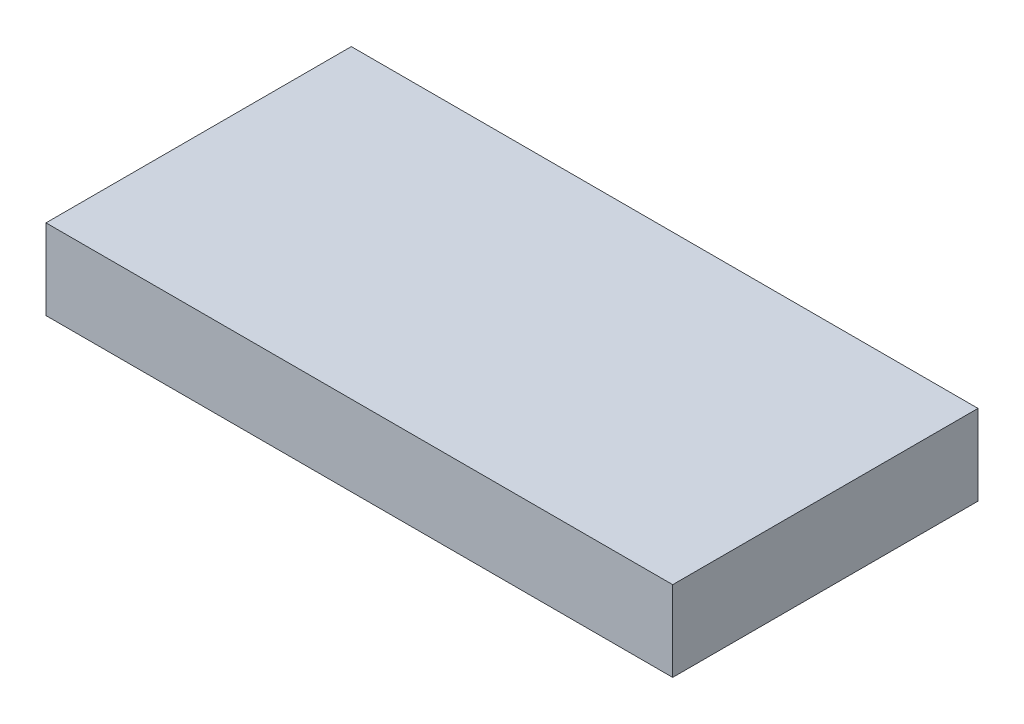
ISO-10303-21;
HEADER;
FILE_DESCRIPTION(('STEP AP214'),'2;1');
FILE_NAME('part.step','',(''),(''),'','','');
FILE_SCHEMA(('AUTOMOTIVE_DESIGN { 1 0 10303 214 1 1 1 1 }'));
ENDSEC;
DATA;
#1=APPLICATION_CONTEXT('core data for automotive mechanical design processes');
#2=APPLICATION_PROTOCOL_DEFINITION('international standard','automotive_design',2000,#1);
#3=PRODUCT_CONTEXT('',#1,'mechanical');
#4=PRODUCT('Part','Part','',(#3));
#5=PRODUCT_RELATED_PRODUCT_CATEGORY('part','',(#4));
#6=PRODUCT_DEFINITION_FORMATION('','',#4);
#7=PRODUCT_DEFINITION_CONTEXT('part definition',#1,'design');
#8=PRODUCT_DEFINITION('design','',#6,#7);
#9=PRODUCT_DEFINITION_SHAPE('','',#8);
#10=(LENGTH_UNIT() NAMED_UNIT(*) SI_UNIT(.MILLI.,.METRE.));
#11=(NAMED_UNIT(*) PLANE_ANGLE_UNIT() SI_UNIT($,.RADIAN.));
#12=(NAMED_UNIT(*) SI_UNIT($,.STERADIAN.) SOLID_ANGLE_UNIT());
#13=UNCERTAINTY_MEASURE_WITH_UNIT(LENGTH_MEASURE(1.E-05),#10,'distance_accuracy_value','');
#14=(GEOMETRIC_REPRESENTATION_CONTEXT(3) GLOBAL_UNCERTAINTY_ASSIGNED_CONTEXT((#13)) GLOBAL_UNIT_ASSIGNED_CONTEXT((#10,
#11,#12)) REPRESENTATION_CONTEXT('',''));
#15=CARTESIAN_POINT('',(0.,0.,0.));
#16=DIRECTION('',(0.,0.,1.));
#17=DIRECTION('',(1.,0.,0.));
#18=AXIS2_PLACEMENT_3D('',#15,#16,#17);
#19=CARTESIAN_POINT('',(19.5,5.,9.5));
#20=DIRECTION('',(-1.,0.,0.));
#21=DIRECTION('',(0.,0.,1.));
#22=AXIS2_PLACEMENT_3D('',#19,#20,#21);
#23=PLANE('',#22);
#24=DIRECTION('',(0.,0.,-1.));
#25=VECTOR('',#24,1.);
#26=CARTESIAN_POINT('',(19.5,0.,9.5));
#27=LINE('',#26,#25);
#28=CARTESIAN_POINT('',(19.5,0.,9.5));
#29=VERTEX_POINT('',#28);
#30=CARTESIAN_POINT('',(19.5,0.,-9.5));
#31=VERTEX_POINT('',#30);
#32=EDGE_CURVE('E97',#29,#31,#27,.T.);
#33=ORIENTED_EDGE('',*,*,#32,.T.);
#34=DIRECTION('',(0.,-1.,0.));
#35=VECTOR('',#34,1.);
#36=CARTESIAN_POINT('',(19.5,5.,-9.5));
#37=LINE('',#36,#35);
#38=CARTESIAN_POINT('',(19.5,5.,-9.5));
#39=VERTEX_POINT('',#38);
#40=EDGE_CURVE('E11',#39,#31,#37,.T.);
#41=ORIENTED_EDGE('',*,*,#40,.F.);
#42=DIRECTION('',(0.,0.,-1.));
#43=VECTOR('',#42,1.);
#44=CARTESIAN_POINT('',(19.5,5.,9.5));
#45=LINE('',#44,#43);
#46=CARTESIAN_POINT('',(19.5,5.,9.5));
#47=VERTEX_POINT('',#46);
#48=EDGE_CURVE('E85',#47,#39,#45,.T.);
#49=ORIENTED_EDGE('',*,*,#48,.F.);
#50=DIRECTION('',(0.,-1.,0.));
#51=VECTOR('',#50,1.);
#52=CARTESIAN_POINT('',(19.5,5.,9.5));
#53=LINE('',#52,#51);
#54=EDGE_CURVE('E93',#47,#29,#53,.T.);
#55=ORIENTED_EDGE('',*,*,#54,.T.);
#56=EDGE_LOOP('',(#33,#41,#49,#55));
#57=FACE_BOUND('',#56,.T.);
#58=ADVANCED_FACE('F34',(#57),#23,.F.);
#59=CARTESIAN_POINT('',(-19.5,5.,-9.5));
#60=DIRECTION('',(0.,0.,1.));
#61=DIRECTION('',(1.,0.,0.));
#62=AXIS2_PLACEMENT_3D('',#59,#60,#61);
#63=PLANE('',#62);
#64=DIRECTION('',(-1.,0.,0.));
#65=VECTOR('',#64,1.);
#66=CARTESIAN_POINT('',(-19.5,0.,-9.5));
#67=LINE('',#66,#65);
#68=CARTESIAN_POINT('',(-19.5,0.,-9.5));
#69=VERTEX_POINT('',#68);
#70=EDGE_CURVE('E89',#31,#69,#67,.T.);
#71=ORIENTED_EDGE('',*,*,#70,.T.);
#72=DIRECTION('',(0.,-1.,0.));
#73=VECTOR('',#72,1.);
#74=CARTESIAN_POINT('',(-19.5,5.,-9.5));
#75=LINE('',#74,#73);
#76=CARTESIAN_POINT('',(-19.5,5.,-9.5));
#77=VERTEX_POINT('',#76);
#78=EDGE_CURVE('E42',#77,#69,#75,.T.);
#79=ORIENTED_EDGE('',*,*,#78,.F.);
#80=DIRECTION('',(-1.,0.,0.));
#81=VECTOR('',#80,1.);
#82=CARTESIAN_POINT('',(-19.5,5.,-9.5));
#83=LINE('',#82,#81);
#84=EDGE_CURVE('E80',#39,#77,#83,.T.);
#85=ORIENTED_EDGE('',*,*,#84,.F.);
#86=ORIENTED_EDGE('',*,*,#40,.T.);
#87=EDGE_LOOP('',(#71,#79,#85,#86));
#88=FACE_BOUND('',#87,.T.);
#89=ADVANCED_FACE('F88',(#88),#63,.F.);
#90=CARTESIAN_POINT('',(-19.5,5.,9.5));
#91=DIRECTION('',(1.,0.,0.));
#92=DIRECTION('',(0.,0.,-1.));
#93=AXIS2_PLACEMENT_3D('',#90,#91,#92);
#94=PLANE('',#93);
#95=DIRECTION('',(0.,0.,1.));
#96=VECTOR('',#95,1.);
#97=CARTESIAN_POINT('',(-19.5,0.,9.5));
#98=LINE('',#97,#96);
#99=CARTESIAN_POINT('',(-19.5,0.,9.5));
#100=VERTEX_POINT('',#99);
#101=EDGE_CURVE('E67',#69,#100,#98,.T.);
#102=ORIENTED_EDGE('',*,*,#101,.T.);
#103=DIRECTION('',(0.,-1.,0.));
#104=VECTOR('',#103,1.);
#105=CARTESIAN_POINT('',(-19.5,5.,9.5));
#106=LINE('',#105,#104);
#107=CARTESIAN_POINT('',(-19.5,5.,9.5));
#108=VERTEX_POINT('',#107);
#109=EDGE_CURVE('E90',#108,#100,#106,.T.);
#110=ORIENTED_EDGE('',*,*,#109,.F.);
#111=DIRECTION('',(0.,0.,1.));
#112=VECTOR('',#111,1.);
#113=CARTESIAN_POINT('',(-19.5,5.,9.5));
#114=LINE('',#113,#112);
#115=EDGE_CURVE('E83',#77,#108,#114,.T.);
#116=ORIENTED_EDGE('',*,*,#115,.F.);
#117=ORIENTED_EDGE('',*,*,#78,.T.);
#118=EDGE_LOOP('',(#102,#110,#116,#117));
#119=FACE_BOUND('',#118,.T.);
#120=ADVANCED_FACE('F91',(#119),#94,.F.);
#121=CARTESIAN_POINT('',(-19.5,5.,9.5));
#122=DIRECTION('',(0.,0.,-1.));
#123=DIRECTION('',(-1.,0.,0.));
#124=AXIS2_PLACEMENT_3D('',#121,#122,#123);
#125=PLANE('',#124);
#126=DIRECTION('',(1.,0.,0.));
#127=VECTOR('',#126,1.);
#128=CARTESIAN_POINT('',(-19.5,0.,9.5));
#129=LINE('',#128,#127);
#130=EDGE_CURVE('E73',#100,#29,#129,.T.);
#131=ORIENTED_EDGE('',*,*,#130,.T.);
#132=ORIENTED_EDGE('',*,*,#54,.F.);
#133=DIRECTION('',(1.,0.,0.));
#134=VECTOR('',#133,1.);
#135=CARTESIAN_POINT('',(-19.5,5.,9.5));
#136=LINE('',#135,#134);
#137=EDGE_CURVE('E50',#108,#47,#136,.T.);
#138=ORIENTED_EDGE('',*,*,#137,.F.);
#139=ORIENTED_EDGE('',*,*,#109,.T.);
#140=EDGE_LOOP('',(#131,#132,#138,#139));
#141=FACE_BOUND('',#140,.T.);
#142=ADVANCED_FACE('F104',(#141),#125,.F.);
#143=CARTESIAN_POINT('',(0.,5.,0.));
#144=DIRECTION('',(0.,-1.,0.));
#145=DIRECTION('',(0.,0.,-1.));
#146=AXIS2_PLACEMENT_3D('',#143,#144,#145);
#147=PLANE('',#146);
#148=ORIENTED_EDGE('',*,*,#48,.T.);
#149=ORIENTED_EDGE('',*,*,#84,.T.);
#150=ORIENTED_EDGE('',*,*,#115,.T.);
#151=ORIENTED_EDGE('',*,*,#137,.T.);
#152=EDGE_LOOP('',(#148,#149,#150,#151));
#153=FACE_BOUND('',#152,.T.);
#154=ADVANCED_FACE('F81',(#153),#147,.F.);
#155=CARTESIAN_POINT('',(0.,0.,0.));
#156=DIRECTION('',(0.,-1.,0.));
#157=DIRECTION('',(0.,0.,-1.));
#158=AXIS2_PLACEMENT_3D('',#155,#156,#157);
#159=PLANE('',#158);
#160=ORIENTED_EDGE('',*,*,#32,.F.);
#161=ORIENTED_EDGE('',*,*,#130,.F.);
#162=ORIENTED_EDGE('',*,*,#101,.F.);
#163=ORIENTED_EDGE('',*,*,#70,.F.);
#164=EDGE_LOOP('',(#160,#161,#162,#163));
#165=FACE_BOUND('',#164,.T.);
#166=ADVANCED_FACE('F107',(#165),#159,.T.);
#167=CLOSED_SHELL('',(#58,#89,#120,#142,#154,#166));
#168=MANIFOLD_SOLID_BREP('B2',#167);
#169=ADVANCED_BREP_SHAPE_REPRESENTATION('',(#18,#168),#14);
#170=SHAPE_DEFINITION_REPRESENTATION(#9,#169);
ENDSEC;
END-ISO-10303-21;
